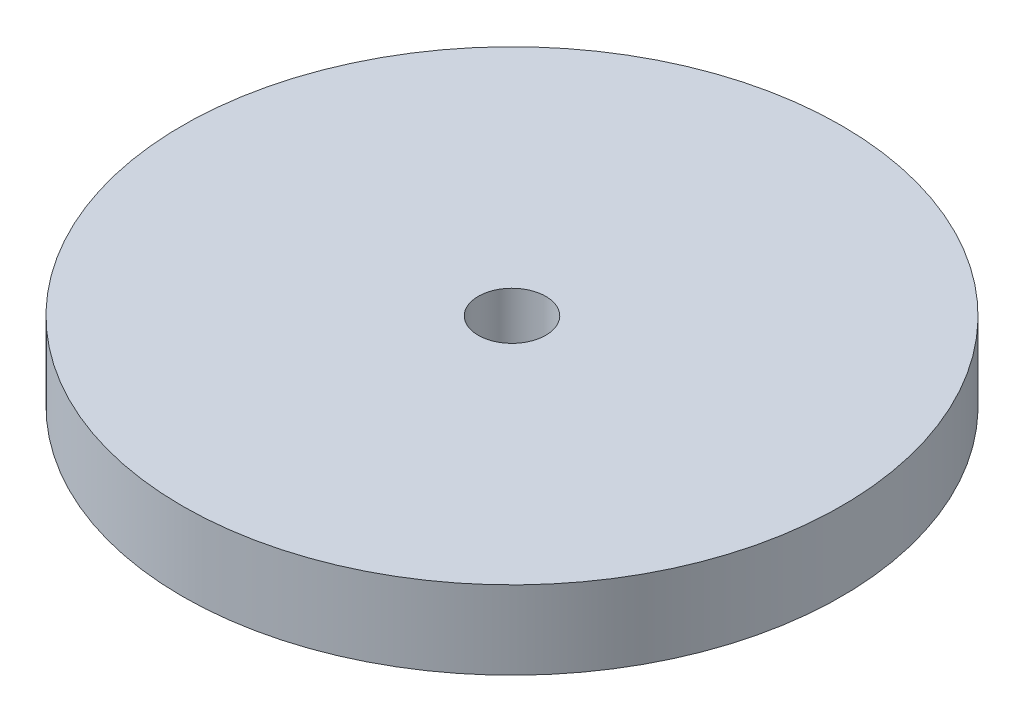
ISO-10303-21;
HEADER;
FILE_DESCRIPTION(('STEP AP214'),'2;1');
FILE_NAME('part.step','',(''),(''),'','','');
FILE_SCHEMA(('AUTOMOTIVE_DESIGN { 1 0 10303 214 1 1 1 1 }'));
ENDSEC;
DATA;
#1=APPLICATION_CONTEXT('core data for automotive mechanical design processes');
#2=APPLICATION_PROTOCOL_DEFINITION('international standard','automotive_design',2000,#1);
#3=PRODUCT_CONTEXT('',#1,'mechanical');
#4=PRODUCT('Part','Part','',(#3));
#5=PRODUCT_RELATED_PRODUCT_CATEGORY('part','',(#4));
#6=PRODUCT_DEFINITION_FORMATION('','',#4);
#7=PRODUCT_DEFINITION_CONTEXT('part definition',#1,'design');
#8=PRODUCT_DEFINITION('design','',#6,#7);
#9=PRODUCT_DEFINITION_SHAPE('','',#8);
#10=(LENGTH_UNIT() NAMED_UNIT(*) SI_UNIT(.MILLI.,.METRE.));
#11=(NAMED_UNIT(*) PLANE_ANGLE_UNIT() SI_UNIT($,.RADIAN.));
#12=(NAMED_UNIT(*) SI_UNIT($,.STERADIAN.) SOLID_ANGLE_UNIT());
#13=UNCERTAINTY_MEASURE_WITH_UNIT(LENGTH_MEASURE(1.E-05),#10,'distance_accuracy_value','');
#14=(GEOMETRIC_REPRESENTATION_CONTEXT(3) GLOBAL_UNCERTAINTY_ASSIGNED_CONTEXT((#13)) GLOBAL_UNIT_ASSIGNED_CONTEXT((#10,
#11,#12)) REPRESENTATION_CONTEXT('',''));
#15=CARTESIAN_POINT('',(0.,0.,0.));
#16=DIRECTION('',(0.,0.,1.));
#17=DIRECTION('',(1.,0.,0.));
#18=AXIS2_PLACEMENT_3D('',#15,#16,#17);
#19=CARTESIAN_POINT('',(0.,9.5,0.));
#20=DIRECTION('',(0.,1.,0.));
#21=DIRECTION('',(0.,0.,1.));
#22=AXIS2_PLACEMENT_3D('',#19,#20,#21);
#23=PLANE('',#22);
#24=CARTESIAN_POINT('',(0.,9.5,0.));
#25=DIRECTION('',(0.,1.,0.));
#26=DIRECTION('',(0.,0.,1.));
#27=AXIS2_PLACEMENT_3D('',#24,#25,#26);
#28=CIRCLE('',#27,40.);
#29=CARTESIAN_POINT('',(0.,9.5,40.));
#30=VERTEX_POINT('',#29);
#31=EDGE_CURVE('E10',#30,#30,#28,.T.);
#32=ORIENTED_EDGE('',*,*,#31,.T.);
#33=EDGE_LOOP('',(#32));
#34=FACE_BOUND('',#33,.T.);
#35=CARTESIAN_POINT('',(0.,9.5,0.));
#36=DIRECTION('',(0.,1.,0.));
#37=DIRECTION('',(0.,0.,1.));
#38=AXIS2_PLACEMENT_3D('',#35,#36,#37);
#39=CIRCLE('',#38,4.1);
#40=CARTESIAN_POINT('',(0.,9.5,4.1));
#41=VERTEX_POINT('',#40);
#42=EDGE_CURVE('E41',#41,#41,#39,.T.);
#43=ORIENTED_EDGE('',*,*,#42,.F.);
#44=EDGE_LOOP('',(#43));
#45=FACE_BOUND('',#44,.T.);
#46=ADVANCED_FACE('F30',(#34,#45),#23,.T.);
#47=CARTESIAN_POINT('',(0.,0.,0.));
#48=DIRECTION('',(0.,1.,0.));
#49=DIRECTION('',(0.,0.,1.));
#50=AXIS2_PLACEMENT_3D('',#47,#48,#49);
#51=PLANE('',#50);
#52=CARTESIAN_POINT('',(0.,0.,0.));
#53=DIRECTION('',(0.,1.,0.));
#54=DIRECTION('',(0.,0.,1.));
#55=AXIS2_PLACEMENT_3D('',#52,#53,#54);
#56=CIRCLE('',#55,40.);
#57=CARTESIAN_POINT('',(0.,0.,40.));
#58=VERTEX_POINT('',#57);
#59=EDGE_CURVE('E34',#58,#58,#56,.T.);
#60=ORIENTED_EDGE('',*,*,#59,.F.);
#61=EDGE_LOOP('',(#60));
#62=FACE_BOUND('',#61,.T.);
#63=CARTESIAN_POINT('',(0.,0.,0.));
#64=DIRECTION('',(0.,1.,0.));
#65=DIRECTION('',(0.,0.,1.));
#66=AXIS2_PLACEMENT_3D('',#63,#64,#65);
#67=CIRCLE('',#66,4.1);
#68=CARTESIAN_POINT('',(0.,0.,4.1));
#69=VERTEX_POINT('',#68);
#70=EDGE_CURVE('E43',#69,#69,#67,.T.);
#71=ORIENTED_EDGE('',*,*,#70,.T.);
#72=EDGE_LOOP('',(#71));
#73=FACE_BOUND('',#72,.T.);
#74=ADVANCED_FACE('F53',(#62,#73),#51,.F.);
#75=CARTESIAN_POINT('',(0.,9.5,0.));
#76=DIRECTION('',(0.,-1.,0.));
#77=DIRECTION('',(0.,0.,-1.));
#78=AXIS2_PLACEMENT_3D('',#75,#76,#77);
#79=CYLINDRICAL_SURFACE('',#78,40.);
#80=ORIENTED_EDGE('',*,*,#31,.F.);
#81=EDGE_LOOP('',(#80));
#82=FACE_BOUND('',#81,.T.);
#83=ORIENTED_EDGE('',*,*,#59,.T.);
#84=EDGE_LOOP('',(#83));
#85=FACE_BOUND('',#84,.T.);
#86=ADVANCED_FACE('F32',(#82,#85),#79,.T.);
#87=CARTESIAN_POINT('',(0.,9.5,0.));
#88=DIRECTION('',(0.,-1.,0.));
#89=DIRECTION('',(0.,0.,-1.));
#90=AXIS2_PLACEMENT_3D('',#87,#88,#89);
#91=CYLINDRICAL_SURFACE('',#90,4.1);
#92=ORIENTED_EDGE('',*,*,#42,.T.);
#93=EDGE_LOOP('',(#92));
#94=FACE_BOUND('',#93,.T.);
#95=ORIENTED_EDGE('',*,*,#70,.F.);
#96=EDGE_LOOP('',(#95));
#97=FACE_BOUND('',#96,.T.);
#98=ADVANCED_FACE('F49',(#94,#97),#91,.F.);
#99=CLOSED_SHELL('',(#46,#74,#86,#98));
#100=MANIFOLD_SOLID_BREP('B2',#99);
#101=ADVANCED_BREP_SHAPE_REPRESENTATION('',(#18,#100),#14);
#102=SHAPE_DEFINITION_REPRESENTATION(#9,#101);
ENDSEC;
END-ISO-10303-21;
